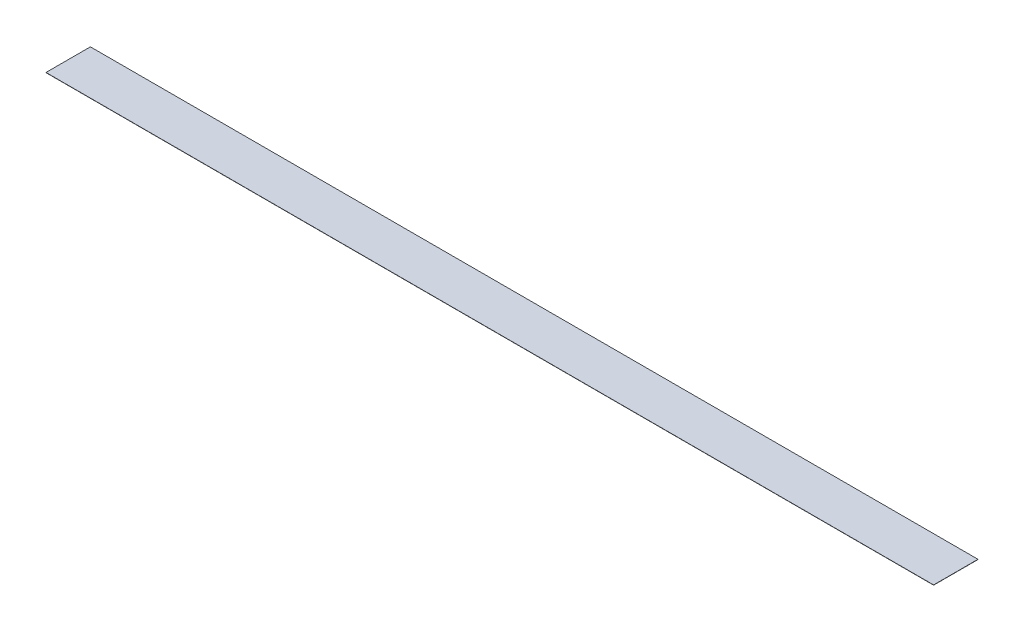
ISO-10303-21;
HEADER;
FILE_DESCRIPTION(('STEP AP214'),'2;1');
FILE_NAME('part.step','',(''),(''),'','','');
FILE_SCHEMA(('AUTOMOTIVE_DESIGN { 1 0 10303 214 1 1 1 1 }'));
ENDSEC;
DATA;
#1=APPLICATION_CONTEXT('core data for automotive mechanical design processes');
#2=APPLICATION_PROTOCOL_DEFINITION('international standard','automotive_design',2000,#1);
#3=PRODUCT_CONTEXT('',#1,'mechanical');
#4=PRODUCT('Part','Part','',(#3));
#5=PRODUCT_RELATED_PRODUCT_CATEGORY('part','',(#4));
#6=PRODUCT_DEFINITION_FORMATION('','',#4);
#7=PRODUCT_DEFINITION_CONTEXT('part definition',#1,'design');
#8=PRODUCT_DEFINITION('design','',#6,#7);
#9=PRODUCT_DEFINITION_SHAPE('','',#8);
#10=(LENGTH_UNIT() NAMED_UNIT(*) SI_UNIT(.MILLI.,.METRE.));
#11=(NAMED_UNIT(*) PLANE_ANGLE_UNIT() SI_UNIT($,.RADIAN.));
#12=(NAMED_UNIT(*) SI_UNIT($,.STERADIAN.) SOLID_ANGLE_UNIT());
#13=UNCERTAINTY_MEASURE_WITH_UNIT(LENGTH_MEASURE(1.E-05),#10,'distance_accuracy_value','');
#14=(GEOMETRIC_REPRESENTATION_CONTEXT(3) GLOBAL_UNCERTAINTY_ASSIGNED_CONTEXT((#13)) GLOBAL_UNIT_ASSIGNED_CONTEXT((#10,
#11,#12)) REPRESENTATION_CONTEXT('',''));
#15=CARTESIAN_POINT('',(0.,0.,0.));
#16=DIRECTION('',(0.,0.,1.));
#17=DIRECTION('',(1.,0.,0.));
#18=AXIS2_PLACEMENT_3D('',#15,#16,#17);
#19=CARTESIAN_POINT('',(508.,0.254,-25.4));
#20=DIRECTION('',(-1.,0.,0.));
#21=DIRECTION('',(0.,0.,1.));
#22=AXIS2_PLACEMENT_3D('',#19,#20,#21);
#23=PLANE('',#22);
#24=DIRECTION('',(0.,0.,-1.));
#25=VECTOR('',#24,1.);
#26=CARTESIAN_POINT('',(508.,0.,-25.4));
#27=LINE('',#26,#25);
#28=CARTESIAN_POINT('',(508.,0.,25.4));
#29=VERTEX_POINT('',#28);
#30=CARTESIAN_POINT('',(508.,0.,-25.4));
#31=VERTEX_POINT('',#30);
#32=EDGE_CURVE('E97',#29,#31,#27,.T.);
#33=ORIENTED_EDGE('',*,*,#32,.T.);
#34=DIRECTION('',(0.,-1.,0.));
#35=VECTOR('',#34,1.);
#36=CARTESIAN_POINT('',(508.,0.254,-25.4));
#37=LINE('',#36,#35);
#38=CARTESIAN_POINT('',(508.,0.254,-25.4));
#39=VERTEX_POINT('',#38);
#40=EDGE_CURVE('E11',#39,#31,#37,.T.);
#41=ORIENTED_EDGE('',*,*,#40,.F.);
#42=DIRECTION('',(0.,0.,-1.));
#43=VECTOR('',#42,1.);
#44=CARTESIAN_POINT('',(508.,0.254,-25.4));
#45=LINE('',#44,#43);
#46=CARTESIAN_POINT('',(508.,0.254,25.4));
#47=VERTEX_POINT('',#46);
#48=EDGE_CURVE('E85',#47,#39,#45,.T.);
#49=ORIENTED_EDGE('',*,*,#48,.F.);
#50=DIRECTION('',(0.,-1.,0.));
#51=VECTOR('',#50,1.);
#52=CARTESIAN_POINT('',(508.,0.254,25.4));
#53=LINE('',#52,#51);
#54=EDGE_CURVE('E93',#47,#29,#53,.T.);
#55=ORIENTED_EDGE('',*,*,#54,.T.);
#56=EDGE_LOOP('',(#33,#41,#49,#55));
#57=FACE_BOUND('',#56,.T.);
#58=ADVANCED_FACE('F34',(#57),#23,.F.);
#59=CARTESIAN_POINT('',(-508.,0.254,-25.4));
#60=DIRECTION('',(0.,0.,1.));
#61=DIRECTION('',(1.,0.,0.));
#62=AXIS2_PLACEMENT_3D('',#59,#60,#61);
#63=PLANE('',#62);
#64=DIRECTION('',(-1.,0.,0.));
#65=VECTOR('',#64,1.);
#66=CARTESIAN_POINT('',(-508.,0.,-25.4));
#67=LINE('',#66,#65);
#68=CARTESIAN_POINT('',(-508.,0.,-25.4));
#69=VERTEX_POINT('',#68);
#70=EDGE_CURVE('E89',#31,#69,#67,.T.);
#71=ORIENTED_EDGE('',*,*,#70,.T.);
#72=DIRECTION('',(0.,-1.,0.));
#73=VECTOR('',#72,1.);
#74=CARTESIAN_POINT('',(-508.,0.254,-25.4));
#75=LINE('',#74,#73);
#76=CARTESIAN_POINT('',(-508.,0.254,-25.4));
#77=VERTEX_POINT('',#76);
#78=EDGE_CURVE('E42',#77,#69,#75,.T.);
#79=ORIENTED_EDGE('',*,*,#78,.F.);
#80=DIRECTION('',(-1.,0.,0.));
#81=VECTOR('',#80,1.);
#82=CARTESIAN_POINT('',(-508.,0.254,-25.4));
#83=LINE('',#82,#81);
#84=EDGE_CURVE('E80',#39,#77,#83,.T.);
#85=ORIENTED_EDGE('',*,*,#84,.F.);
#86=ORIENTED_EDGE('',*,*,#40,.T.);
#87=EDGE_LOOP('',(#71,#79,#85,#86));
#88=FACE_BOUND('',#87,.T.);
#89=ADVANCED_FACE('F88',(#88),#63,.F.);
#90=CARTESIAN_POINT('',(-508.,0.254,-25.4));
#91=DIRECTION('',(1.,0.,0.));
#92=DIRECTION('',(0.,0.,-1.));
#93=AXIS2_PLACEMENT_3D('',#90,#91,#92);
#94=PLANE('',#93);
#95=DIRECTION('',(0.,0.,1.));
#96=VECTOR('',#95,1.);
#97=CARTESIAN_POINT('',(-508.,0.,-25.4));
#98=LINE('',#97,#96);
#99=CARTESIAN_POINT('',(-508.,0.,25.4));
#100=VERTEX_POINT('',#99);
#101=EDGE_CURVE('E67',#69,#100,#98,.T.);
#102=ORIENTED_EDGE('',*,*,#101,.T.);
#103=DIRECTION('',(0.,-1.,0.));
#104=VECTOR('',#103,1.);
#105=CARTESIAN_POINT('',(-508.,0.254,25.4));
#106=LINE('',#105,#104);
#107=CARTESIAN_POINT('',(-508.,0.254,25.4));
#108=VERTEX_POINT('',#107);
#109=EDGE_CURVE('E90',#108,#100,#106,.T.);
#110=ORIENTED_EDGE('',*,*,#109,.F.);
#111=DIRECTION('',(0.,0.,1.));
#112=VECTOR('',#111,1.);
#113=CARTESIAN_POINT('',(-508.,0.254,-25.4));
#114=LINE('',#113,#112);
#115=EDGE_CURVE('E83',#77,#108,#114,.T.);
#116=ORIENTED_EDGE('',*,*,#115,.F.);
#117=ORIENTED_EDGE('',*,*,#78,.T.);
#118=EDGE_LOOP('',(#102,#110,#116,#117));
#119=FACE_BOUND('',#118,.T.);
#120=ADVANCED_FACE('F91',(#119),#94,.F.);
#121=CARTESIAN_POINT('',(-508.,0.254,25.4));
#122=DIRECTION('',(0.,0.,-1.));
#123=DIRECTION('',(-1.,0.,0.));
#124=AXIS2_PLACEMENT_3D('',#121,#122,#123);
#125=PLANE('',#124);
#126=DIRECTION('',(1.,0.,0.));
#127=VECTOR('',#126,1.);
#128=CARTESIAN_POINT('',(-508.,0.,25.4));
#129=LINE('',#128,#127);
#130=EDGE_CURVE('E73',#100,#29,#129,.T.);
#131=ORIENTED_EDGE('',*,*,#130,.T.);
#132=ORIENTED_EDGE('',*,*,#54,.F.);
#133=DIRECTION('',(1.,0.,0.));
#134=VECTOR('',#133,1.);
#135=CARTESIAN_POINT('',(-508.,0.254,25.4));
#136=LINE('',#135,#134);
#137=EDGE_CURVE('E50',#108,#47,#136,.T.);
#138=ORIENTED_EDGE('',*,*,#137,.F.);
#139=ORIENTED_EDGE('',*,*,#109,.T.);
#140=EDGE_LOOP('',(#131,#132,#138,#139));
#141=FACE_BOUND('',#140,.T.);
#142=ADVANCED_FACE('F104',(#141),#125,.F.);
#143=CARTESIAN_POINT('',(0.,0.254,0.));
#144=DIRECTION('',(0.,1.,0.));
#145=DIRECTION('',(0.,0.,1.));
#146=AXIS2_PLACEMENT_3D('',#143,#144,#145);
#147=PLANE('',#146);
#148=ORIENTED_EDGE('',*,*,#48,.T.);
#149=ORIENTED_EDGE('',*,*,#84,.T.);
#150=ORIENTED_EDGE('',*,*,#115,.T.);
#151=ORIENTED_EDGE('',*,*,#137,.T.);
#152=EDGE_LOOP('',(#148,#149,#150,#151));
#153=FACE_BOUND('',#152,.T.);
#154=ADVANCED_FACE('F81',(#153),#147,.T.);
#155=CARTESIAN_POINT('',(0.,0.,0.));
#156=DIRECTION('',(0.,1.,0.));
#157=DIRECTION('',(0.,0.,1.));
#158=AXIS2_PLACEMENT_3D('',#155,#156,#157);
#159=PLANE('',#158);
#160=ORIENTED_EDGE('',*,*,#32,.F.);
#161=ORIENTED_EDGE('',*,*,#130,.F.);
#162=ORIENTED_EDGE('',*,*,#101,.F.);
#163=ORIENTED_EDGE('',*,*,#70,.F.);
#164=EDGE_LOOP('',(#160,#161,#162,#163));
#165=FACE_BOUND('',#164,.T.);
#166=ADVANCED_FACE('F107',(#165),#159,.F.);
#167=CLOSED_SHELL('',(#58,#89,#120,#142,#154,#166));
#168=MANIFOLD_SOLID_BREP('B2',#167);
#169=ADVANCED_BREP_SHAPE_REPRESENTATION('',(#18,#168),#14);
#170=SHAPE_DEFINITION_REPRESENTATION(#9,#169);
ENDSEC;
END-ISO-10303-21;
